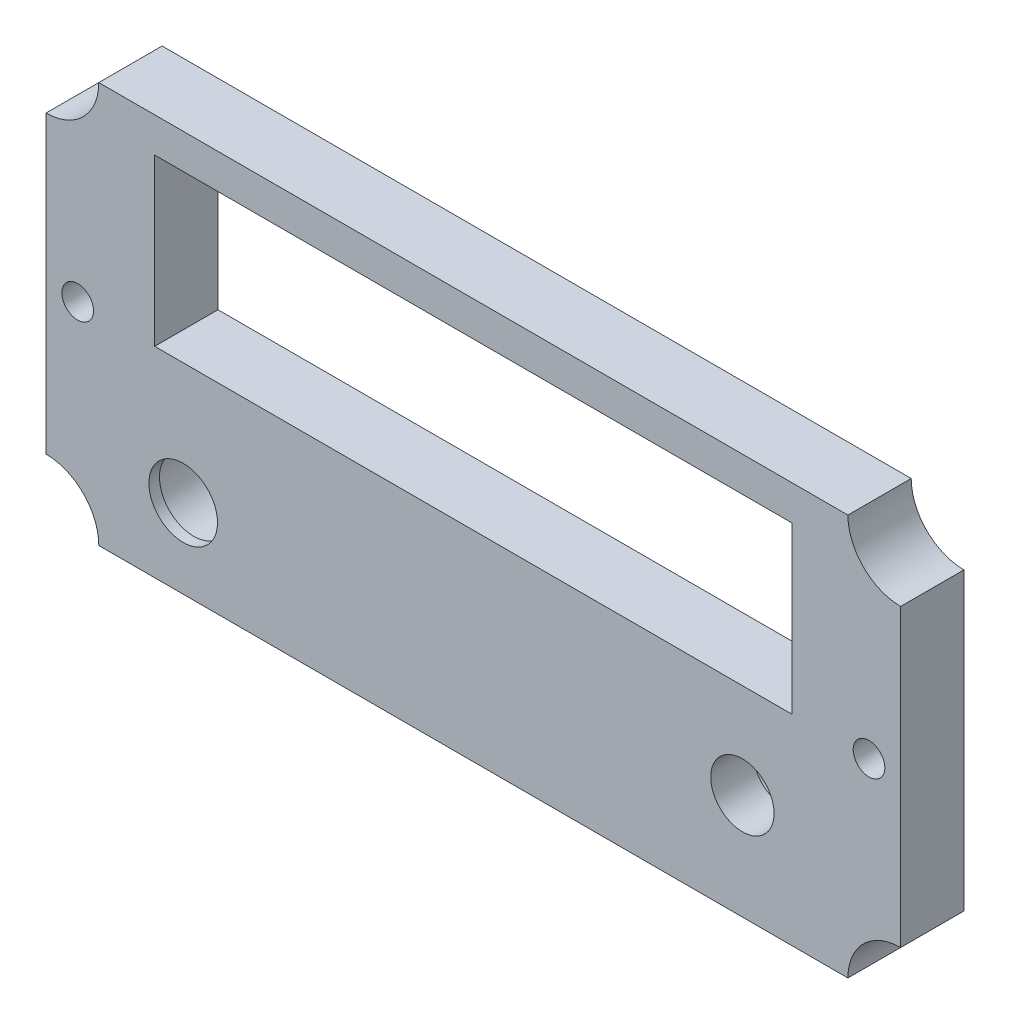
ISO-10303-21;
HEADER;
FILE_DESCRIPTION(('STEP AP214'),'2;1');
FILE_NAME('part.step','',(''),(''),'','','');
FILE_SCHEMA(('AUTOMOTIVE_DESIGN { 1 0 10303 214 1 1 1 1 }'));
ENDSEC;
DATA;
#1=APPLICATION_CONTEXT('core data for automotive mechanical design processes');
#2=APPLICATION_PROTOCOL_DEFINITION('international standard','automotive_design',2000,#1);
#3=PRODUCT_CONTEXT('',#1,'mechanical');
#4=PRODUCT('Part','Part','',(#3));
#5=PRODUCT_RELATED_PRODUCT_CATEGORY('part','',(#4));
#6=PRODUCT_DEFINITION_FORMATION('','',#4);
#7=PRODUCT_DEFINITION_CONTEXT('part definition',#1,'design');
#8=PRODUCT_DEFINITION('design','',#6,#7);
#9=PRODUCT_DEFINITION_SHAPE('','',#8);
#10=(LENGTH_UNIT() NAMED_UNIT(*) SI_UNIT(.MILLI.,.METRE.));
#11=(NAMED_UNIT(*) PLANE_ANGLE_UNIT() SI_UNIT($,.RADIAN.));
#12=(NAMED_UNIT(*) SI_UNIT($,.STERADIAN.) SOLID_ANGLE_UNIT());
#13=UNCERTAINTY_MEASURE_WITH_UNIT(LENGTH_MEASURE(1.E-05),#10,'distance_accuracy_value','');
#14=(GEOMETRIC_REPRESENTATION_CONTEXT(3) GLOBAL_UNCERTAINTY_ASSIGNED_CONTEXT((#13)) GLOBAL_UNIT_ASSIGNED_CONTEXT((#10,
#11,#12)) REPRESENTATION_CONTEXT('',''));
#15=CARTESIAN_POINT('',(0.,0.,0.));
#16=DIRECTION('',(0.,0.,1.));
#17=DIRECTION('',(1.,0.,0.));
#18=AXIS2_PLACEMENT_3D('',#15,#16,#17);
#19=CARTESIAN_POINT('',(25.5,-9.00000000000001,0.));
#20=DIRECTION('',(0.,0.,1.));
#21=DIRECTION('',(1.,0.,0.));
#22=AXIS2_PLACEMENT_3D('',#19,#20,#21);
#23=CYLINDRICAL_SURFACE('',#22,3.425);
#24=CARTESIAN_POINT('',(25.5,-9.00000000000001,0.));
#25=DIRECTION('',(0.,0.,1.));
#26=DIRECTION('',(1.,0.,0.));
#27=AXIS2_PLACEMENT_3D('',#24,#25,#26);
#28=CIRCLE('',#27,3.425);
#29=CARTESIAN_POINT('',(28.925,-9.00000000000001,0.));
#30=VERTEX_POINT('',#29);
#31=EDGE_CURVE('E340',#30,#30,#28,.T.);
#32=ORIENTED_EDGE('',*,*,#31,.F.);
#33=EDGE_LOOP('',(#32));
#34=FACE_BOUND('',#33,.T.);
#35=CARTESIAN_POINT('',(25.5,-9.00000000000001,2.));
#36=DIRECTION('',(0.,0.,1.));
#37=DIRECTION('',(1.,0.,0.));
#38=AXIS2_PLACEMENT_3D('',#35,#36,#37);
#39=CIRCLE('',#38,3.425);
#40=CARTESIAN_POINT('',(28.925,-9.00000000000001,2.));
#41=VERTEX_POINT('',#40);
#42=EDGE_CURVE('E11',#41,#41,#39,.F.);
#43=ORIENTED_EDGE('',*,*,#42,.F.);
#44=EDGE_LOOP('',(#43));
#45=FACE_BOUND('',#44,.T.);
#46=ADVANCED_FACE('F33',(#34,#45),#23,.F.);
#47=CARTESIAN_POINT('',(-27.5,-11.5,0.));
#48=DIRECTION('',(0.,0.,1.));
#49=DIRECTION('',(1.,0.,0.));
#50=AXIS2_PLACEMENT_3D('',#47,#48,#49);
#51=CYLINDRICAL_SURFACE('',#50,3.75);
#52=CARTESIAN_POINT('',(-27.5,-11.5,0.));
#53=DIRECTION('',(0.,0.,1.));
#54=DIRECTION('',(1.,0.,0.));
#55=AXIS2_PLACEMENT_3D('',#52,#53,#54);
#56=CIRCLE('',#55,3.75);
#57=CARTESIAN_POINT('',(-23.75,-11.5,0.));
#58=VERTEX_POINT('',#57);
#59=EDGE_CURVE('E146',#58,#58,#56,.T.);
#60=ORIENTED_EDGE('',*,*,#59,.F.);
#61=EDGE_LOOP('',(#60));
#62=FACE_BOUND('',#61,.T.);
#63=CARTESIAN_POINT('',(-27.5,-11.5,5.));
#64=DIRECTION('',(0.,0.,1.));
#65=DIRECTION('',(1.,0.,0.));
#66=AXIS2_PLACEMENT_3D('',#63,#64,#65);
#67=CIRCLE('',#66,3.75);
#68=CARTESIAN_POINT('',(-23.75,-11.5,5.));
#69=VERTEX_POINT('',#68);
#70=EDGE_CURVE('E41',#69,#69,#67,.F.);
#71=ORIENTED_EDGE('',*,*,#70,.F.);
#72=EDGE_LOOP('',(#71));
#73=FACE_BOUND('',#72,.T.);
#74=ADVANCED_FACE('F235',(#62,#73),#51,.F.);
#75=CARTESIAN_POINT('',(-40.5,19.,6.));
#76=DIRECTION('',(0.,0.,-1.));
#77=DIRECTION('',(-1.,0.,0.));
#78=AXIS2_PLACEMENT_3D('',#75,#76,#77);
#79=CYLINDRICAL_SURFACE('',#78,5.);
#80=CARTESIAN_POINT('',(-40.5,19.,0.));
#81=DIRECTION('',(0.,0.,-1.));
#82=DIRECTION('',(1.,0.,0.));
#83=AXIS2_PLACEMENT_3D('',#80,#81,#82);
#84=CIRCLE('',#83,5.);
#85=CARTESIAN_POINT('',(-35.5,19.,0.));
#86=VERTEX_POINT('',#85);
#87=CARTESIAN_POINT('',(-40.5,14.,0.));
#88=VERTEX_POINT('',#87);
#89=EDGE_CURVE('E173',#86,#88,#84,.T.);
#90=ORIENTED_EDGE('',*,*,#89,.T.);
#91=DIRECTION('',(0.,0.,-1.));
#92=VECTOR('',#91,1.);
#93=CARTESIAN_POINT('',(-40.5,14.,6.));
#94=LINE('',#93,#92);
#95=CARTESIAN_POINT('',(-40.5,14.,6.));
#96=VERTEX_POINT('',#95);
#97=EDGE_CURVE('E228',#96,#88,#94,.T.);
#98=ORIENTED_EDGE('',*,*,#97,.F.);
#99=CARTESIAN_POINT('',(-40.5,19.,6.));
#100=DIRECTION('',(0.,0.,-1.));
#101=DIRECTION('',(1.,0.,0.));
#102=AXIS2_PLACEMENT_3D('',#99,#100,#101);
#103=CIRCLE('',#102,5.);
#104=CARTESIAN_POINT('',(-35.5,19.,6.));
#105=VERTEX_POINT('',#104);
#106=EDGE_CURVE('E174',#105,#96,#103,.T.);
#107=ORIENTED_EDGE('',*,*,#106,.F.);
#108=DIRECTION('',(0.,0.,-1.));
#109=VECTOR('',#108,1.);
#110=CARTESIAN_POINT('',(-35.5,19.,6.));
#111=LINE('',#110,#109);
#112=EDGE_CURVE('E192',#105,#86,#111,.T.);
#113=ORIENTED_EDGE('',*,*,#112,.T.);
#114=EDGE_LOOP('',(#90,#98,#107,#113));
#115=FACE_BOUND('',#114,.T.);
#116=ADVANCED_FACE('F35',(#115),#79,.F.);
#117=CARTESIAN_POINT('',(-40.5,14.,6.));
#118=DIRECTION('',(1.,0.,0.));
#119=DIRECTION('',(0.,0.,-1.));
#120=AXIS2_PLACEMENT_3D('',#117,#118,#119);
#121=PLANE('',#120);
#122=DIRECTION('',(0.,-1.,0.));
#123=VECTOR('',#122,1.);
#124=CARTESIAN_POINT('',(-40.5,14.,0.));
#125=LINE('',#124,#123);
#126=CARTESIAN_POINT('',(-40.5,-14.,0.));
#127=VERTEX_POINT('',#126);
#128=EDGE_CURVE('E195',#88,#127,#125,.T.);
#129=ORIENTED_EDGE('',*,*,#128,.T.);
#130=DIRECTION('',(0.,0.,-1.));
#131=VECTOR('',#130,1.);
#132=CARTESIAN_POINT('',(-40.5,-14.,6.));
#133=LINE('',#132,#131);
#134=CARTESIAN_POINT('',(-40.5,-14.,6.));
#135=VERTEX_POINT('',#134);
#136=EDGE_CURVE('E225',#135,#127,#133,.T.);
#137=ORIENTED_EDGE('',*,*,#136,.F.);
#138=DIRECTION('',(0.,-1.,0.));
#139=VECTOR('',#138,1.);
#140=CARTESIAN_POINT('',(-40.5,14.,6.));
#141=LINE('',#140,#139);
#142=EDGE_CURVE('E177',#96,#135,#141,.T.);
#143=ORIENTED_EDGE('',*,*,#142,.F.);
#144=ORIENTED_EDGE('',*,*,#97,.T.);
#145=EDGE_LOOP('',(#129,#137,#143,#144));
#146=FACE_BOUND('',#145,.T.);
#147=ADVANCED_FACE('F243',(#146),#121,.F.);
#148=CARTESIAN_POINT('',(-40.5,-19.,6.));
#149=DIRECTION('',(0.,0.,-1.));
#150=DIRECTION('',(-1.,0.,0.));
#151=AXIS2_PLACEMENT_3D('',#148,#149,#150);
#152=CYLINDRICAL_SURFACE('',#151,5.);
#153=CARTESIAN_POINT('',(-40.5,-19.,0.));
#154=DIRECTION('',(0.,0.,-1.));
#155=DIRECTION('',(-1.,0.,0.));
#156=AXIS2_PLACEMENT_3D('',#153,#154,#155);
#157=CIRCLE('',#156,5.);
#158=CARTESIAN_POINT('',(-35.5,-19.,0.));
#159=VERTEX_POINT('',#158);
#160=EDGE_CURVE('E197',#127,#159,#157,.T.);
#161=ORIENTED_EDGE('',*,*,#160,.T.);
#162=DIRECTION('',(0.,0.,-1.));
#163=VECTOR('',#162,1.);
#164=CARTESIAN_POINT('',(-35.5,-19.,6.));
#165=LINE('',#164,#163);
#166=CARTESIAN_POINT('',(-35.5,-19.,6.));
#167=VERTEX_POINT('',#166);
#168=EDGE_CURVE('E222',#167,#159,#165,.T.);
#169=ORIENTED_EDGE('',*,*,#168,.F.);
#170=CARTESIAN_POINT('',(-40.5,-19.,6.));
#171=DIRECTION('',(0.,0.,-1.));
#172=DIRECTION('',(-1.,0.,0.));
#173=AXIS2_PLACEMENT_3D('',#170,#171,#172);
#174=CIRCLE('',#173,5.);
#175=EDGE_CURVE('E180',#135,#167,#174,.T.);
#176=ORIENTED_EDGE('',*,*,#175,.F.);
#177=ORIENTED_EDGE('',*,*,#136,.T.);
#178=EDGE_LOOP('',(#161,#169,#176,#177));
#179=FACE_BOUND('',#178,.T.);
#180=ADVANCED_FACE('F296',(#179),#152,.F.);
#181=CARTESIAN_POINT('',(-35.5,-19.,6.));
#182=DIRECTION('',(0.,1.,0.));
#183=DIRECTION('',(-1.,0.,0.));
#184=AXIS2_PLACEMENT_3D('',#181,#182,#183);
#185=PLANE('',#184);
#186=DIRECTION('',(1.,0.,0.));
#187=VECTOR('',#186,1.);
#188=CARTESIAN_POINT('',(-35.5,-19.,0.));
#189=LINE('',#188,#187);
#190=CARTESIAN_POINT('',(35.5,-19.,0.));
#191=VERTEX_POINT('',#190);
#192=EDGE_CURVE('E199',#159,#191,#189,.T.);
#193=ORIENTED_EDGE('',*,*,#192,.T.);
#194=DIRECTION('',(0.,0.,-1.));
#195=VECTOR('',#194,1.);
#196=CARTESIAN_POINT('',(35.5,-19.,6.));
#197=LINE('',#196,#195);
#198=CARTESIAN_POINT('',(35.5,-19.,6.));
#199=VERTEX_POINT('',#198);
#200=EDGE_CURVE('E219',#199,#191,#197,.T.);
#201=ORIENTED_EDGE('',*,*,#200,.F.);
#202=DIRECTION('',(1.,0.,0.));
#203=VECTOR('',#202,1.);
#204=CARTESIAN_POINT('',(-35.5,-19.,6.));
#205=LINE('',#204,#203);
#206=EDGE_CURVE('E182',#167,#199,#205,.T.);
#207=ORIENTED_EDGE('',*,*,#206,.F.);
#208=ORIENTED_EDGE('',*,*,#168,.T.);
#209=EDGE_LOOP('',(#193,#201,#207,#208));
#210=FACE_BOUND('',#209,.T.);
#211=ADVANCED_FACE('F292',(#210),#185,.F.);
#212=CARTESIAN_POINT('',(40.5,-19.,6.));
#213=DIRECTION('',(0.,0.,-1.));
#214=DIRECTION('',(-1.,0.,0.));
#215=AXIS2_PLACEMENT_3D('',#212,#213,#214);
#216=CYLINDRICAL_SURFACE('',#215,5.);
#217=CARTESIAN_POINT('',(40.5,-19.,0.));
#218=DIRECTION('',(0.,0.,-1.));
#219=DIRECTION('',(1.,0.,0.));
#220=AXIS2_PLACEMENT_3D('',#217,#218,#219);
#221=CIRCLE('',#220,5.);
#222=CARTESIAN_POINT('',(40.5,-14.,0.));
#223=VERTEX_POINT('',#222);
#224=EDGE_CURVE('E201',#191,#223,#221,.T.);
#225=ORIENTED_EDGE('',*,*,#224,.T.);
#226=DIRECTION('',(0.,0.,-1.));
#227=VECTOR('',#226,1.);
#228=CARTESIAN_POINT('',(40.5,-14.,6.));
#229=LINE('',#228,#227);
#230=CARTESIAN_POINT('',(40.5,-14.,6.));
#231=VERTEX_POINT('',#230);
#232=EDGE_CURVE('E216',#231,#223,#229,.T.);
#233=ORIENTED_EDGE('',*,*,#232,.F.);
#234=CARTESIAN_POINT('',(40.5,-19.,6.));
#235=DIRECTION('',(0.,0.,-1.));
#236=DIRECTION('',(1.,0.,0.));
#237=AXIS2_PLACEMENT_3D('',#234,#235,#236);
#238=CIRCLE('',#237,5.);
#239=EDGE_CURVE('E184',#199,#231,#238,.T.);
#240=ORIENTED_EDGE('',*,*,#239,.F.);
#241=ORIENTED_EDGE('',*,*,#200,.T.);
#242=EDGE_LOOP('',(#225,#233,#240,#241));
#243=FACE_BOUND('',#242,.T.);
#244=ADVANCED_FACE('F288',(#243),#216,.F.);
#245=CARTESIAN_POINT('',(40.5,14.,6.));
#246=DIRECTION('',(-1.,0.,0.));
#247=DIRECTION('',(0.,0.,1.));
#248=AXIS2_PLACEMENT_3D('',#245,#246,#247);
#249=PLANE('',#248);
#250=DIRECTION('',(0.,1.,0.));
#251=VECTOR('',#250,1.);
#252=CARTESIAN_POINT('',(40.5,14.,0.));
#253=LINE('',#252,#251);
#254=CARTESIAN_POINT('',(40.5,14.,0.));
#255=VERTEX_POINT('',#254);
#256=EDGE_CURVE('E203',#223,#255,#253,.T.);
#257=ORIENTED_EDGE('',*,*,#256,.T.);
#258=DIRECTION('',(0.,0.,-1.));
#259=VECTOR('',#258,1.);
#260=CARTESIAN_POINT('',(40.5,14.,6.));
#261=LINE('',#260,#259);
#262=CARTESIAN_POINT('',(40.5,14.,6.));
#263=VERTEX_POINT('',#262);
#264=EDGE_CURVE('E213',#263,#255,#261,.T.);
#265=ORIENTED_EDGE('',*,*,#264,.F.);
#266=DIRECTION('',(0.,1.,0.));
#267=VECTOR('',#266,1.);
#268=CARTESIAN_POINT('',(40.5,14.,6.));
#269=LINE('',#268,#267);
#270=EDGE_CURVE('E186',#231,#263,#269,.T.);
#271=ORIENTED_EDGE('',*,*,#270,.F.);
#272=ORIENTED_EDGE('',*,*,#232,.T.);
#273=EDGE_LOOP('',(#257,#265,#271,#272));
#274=FACE_BOUND('',#273,.T.);
#275=ADVANCED_FACE('F284',(#274),#249,.F.);
#276=CARTESIAN_POINT('',(40.5,19.,6.));
#277=DIRECTION('',(0.,0.,-1.));
#278=DIRECTION('',(-1.,0.,0.));
#279=AXIS2_PLACEMENT_3D('',#276,#277,#278);
#280=CYLINDRICAL_SURFACE('',#279,5.00000000000001);
#281=CARTESIAN_POINT('',(40.5,19.,0.));
#282=DIRECTION('',(0.,0.,-1.));
#283=DIRECTION('',(-1.,0.,0.));
#284=AXIS2_PLACEMENT_3D('',#281,#282,#283);
#285=CIRCLE('',#284,5.00000000000001);
#286=CARTESIAN_POINT('',(35.5,19.,0.));
#287=VERTEX_POINT('',#286);
#288=EDGE_CURVE('E205',#255,#287,#285,.T.);
#289=ORIENTED_EDGE('',*,*,#288,.T.);
#290=DIRECTION('',(0.,0.,-1.));
#291=VECTOR('',#290,1.);
#292=CARTESIAN_POINT('',(35.5,19.,6.));
#293=LINE('',#292,#291);
#294=CARTESIAN_POINT('',(35.5,19.,6.));
#295=VERTEX_POINT('',#294);
#296=EDGE_CURVE('E210',#295,#287,#293,.T.);
#297=ORIENTED_EDGE('',*,*,#296,.F.);
#298=CARTESIAN_POINT('',(40.5,19.,6.));
#299=DIRECTION('',(0.,0.,-1.));
#300=DIRECTION('',(-1.,0.,0.));
#301=AXIS2_PLACEMENT_3D('',#298,#299,#300);
#302=CIRCLE('',#301,5.00000000000001);
#303=EDGE_CURVE('E188',#263,#295,#302,.T.);
#304=ORIENTED_EDGE('',*,*,#303,.F.);
#305=ORIENTED_EDGE('',*,*,#264,.T.);
#306=EDGE_LOOP('',(#289,#297,#304,#305));
#307=FACE_BOUND('',#306,.T.);
#308=ADVANCED_FACE('F280',(#307),#280,.F.);
#309=CARTESIAN_POINT('',(-35.5,19.,6.));
#310=DIRECTION('',(0.,-1.,0.));
#311=DIRECTION('',(1.,0.,0.));
#312=AXIS2_PLACEMENT_3D('',#309,#310,#311);
#313=PLANE('',#312);
#314=DIRECTION('',(-1.,0.,0.));
#315=VECTOR('',#314,1.);
#316=CARTESIAN_POINT('',(-35.5,19.,0.));
#317=LINE('',#316,#315);
#318=EDGE_CURVE('E178',#287,#86,#317,.T.);
#319=ORIENTED_EDGE('',*,*,#318,.T.);
#320=ORIENTED_EDGE('',*,*,#112,.F.);
#321=DIRECTION('',(-1.,0.,0.));
#322=VECTOR('',#321,1.);
#323=CARTESIAN_POINT('',(-35.5,19.,6.));
#324=LINE('',#323,#322);
#325=EDGE_CURVE('E190',#295,#105,#324,.T.);
#326=ORIENTED_EDGE('',*,*,#325,.F.);
#327=ORIENTED_EDGE('',*,*,#296,.T.);
#328=EDGE_LOOP('',(#319,#320,#326,#327));
#329=FACE_BOUND('',#328,.T.);
#330=ADVANCED_FACE('F273',(#329),#313,.F.);
#331=CARTESIAN_POINT('',(-40.5,19.,6.));
#332=DIRECTION('',(0.,0.,1.));
#333=DIRECTION('',(1.,0.,0.));
#334=AXIS2_PLACEMENT_3D('',#331,#332,#333);
#335=PLANE('',#334);
#336=DIRECTION('',(0.,-1.,0.));
#337=VECTOR('',#336,1.);
#338=CARTESIAN_POINT('',(-30.2,15.7,6.));
#339=LINE('',#338,#337);
#340=CARTESIAN_POINT('',(-30.2,15.7,6.));
#341=VERTEX_POINT('',#340);
#342=CARTESIAN_POINT('',(-30.2,0.,6.));
#343=VERTEX_POINT('',#342);
#344=EDGE_CURVE('E48',#341,#343,#339,.T.);
#345=ORIENTED_EDGE('',*,*,#344,.F.);
#346=DIRECTION('',(-1.,0.,0.));
#347=VECTOR('',#346,1.);
#348=CARTESIAN_POINT('',(-30.2,15.7,6.));
#349=LINE('',#348,#347);
#350=CARTESIAN_POINT('',(30.2,15.7,6.));
#351=VERTEX_POINT('',#350);
#352=EDGE_CURVE('E140',#351,#341,#349,.T.);
#353=ORIENTED_EDGE('',*,*,#352,.F.);
#354=DIRECTION('',(0.,1.,0.));
#355=VECTOR('',#354,1.);
#356=CARTESIAN_POINT('',(30.2,15.7,6.));
#357=LINE('',#356,#355);
#358=CARTESIAN_POINT('',(30.2,0.,6.));
#359=VERTEX_POINT('',#358);
#360=EDGE_CURVE('E143',#359,#351,#357,.T.);
#361=ORIENTED_EDGE('',*,*,#360,.F.);
#362=DIRECTION('',(1.,0.,0.));
#363=VECTOR('',#362,1.);
#364=CARTESIAN_POINT('',(-30.2,0.,6.));
#365=LINE('',#364,#363);
#366=EDGE_CURVE('E152',#343,#359,#365,.T.);
#367=ORIENTED_EDGE('',*,*,#366,.F.);
#368=EDGE_LOOP('',(#345,#353,#361,#367));
#369=FACE_BOUND('',#368,.T.);
#370=CARTESIAN_POINT('',(-37.5,0.,6.));
#371=DIRECTION('',(0.,0.,1.));
#372=DIRECTION('',(1.,0.,0.));
#373=AXIS2_PLACEMENT_3D('',#370,#371,#372);
#374=CIRCLE('',#373,1.5);
#375=CARTESIAN_POINT('',(-36.,0.,6.));
#376=VERTEX_POINT('',#375);
#377=EDGE_CURVE('E170',#376,#376,#374,.T.);
#378=ORIENTED_EDGE('',*,*,#377,.F.);
#379=EDGE_LOOP('',(#378));
#380=FACE_BOUND('',#379,.T.);
#381=CARTESIAN_POINT('',(37.5,0.,6.));
#382=DIRECTION('',(0.,0.,1.));
#383=DIRECTION('',(1.,0.,0.));
#384=AXIS2_PLACEMENT_3D('',#381,#382,#383);
#385=CIRCLE('',#384,1.5);
#386=CARTESIAN_POINT('',(39.,0.,6.));
#387=VERTEX_POINT('',#386);
#388=EDGE_CURVE('E165',#387,#387,#385,.T.);
#389=ORIENTED_EDGE('',*,*,#388,.F.);
#390=EDGE_LOOP('',(#389));
#391=FACE_BOUND('',#390,.T.);
#392=ORIENTED_EDGE('',*,*,#106,.T.);
#393=ORIENTED_EDGE('',*,*,#142,.T.);
#394=ORIENTED_EDGE('',*,*,#175,.T.);
#395=ORIENTED_EDGE('',*,*,#206,.T.);
#396=ORIENTED_EDGE('',*,*,#239,.T.);
#397=ORIENTED_EDGE('',*,*,#270,.T.);
#398=ORIENTED_EDGE('',*,*,#303,.T.);
#399=ORIENTED_EDGE('',*,*,#325,.T.);
#400=EDGE_LOOP('',(#392,#393,#394,#395,#396,#397,#398,#399));
#401=FACE_BOUND('',#400,.T.);
#402=CARTESIAN_POINT('',(-27.5,-11.5,6.));
#403=DIRECTION('',(0.,0.,1.));
#404=DIRECTION('',(1.,0.,0.));
#405=AXIS2_PLACEMENT_3D('',#402,#403,#404);
#406=CIRCLE('',#405,3.25);
#407=CARTESIAN_POINT('',(-24.25,-11.5,6.));
#408=VERTEX_POINT('',#407);
#409=EDGE_CURVE('E332',#408,#408,#406,.T.);
#410=ORIENTED_EDGE('',*,*,#409,.F.);
#411=EDGE_LOOP('',(#410));
#412=FACE_BOUND('',#411,.T.);
#413=CARTESIAN_POINT('',(25.5,-9.00000000000001,6.));
#414=DIRECTION('',(0.,0.,1.));
#415=DIRECTION('',(1.,0.,0.));
#416=AXIS2_PLACEMENT_3D('',#413,#414,#415);
#417=CIRCLE('',#416,3.);
#418=CARTESIAN_POINT('',(28.5,-9.00000000000001,6.));
#419=VERTEX_POINT('',#418);
#420=EDGE_CURVE('E335',#419,#419,#417,.T.);
#421=ORIENTED_EDGE('',*,*,#420,.F.);
#422=EDGE_LOOP('',(#421));
#423=FACE_BOUND('',#422,.T.);
#424=ADVANCED_FACE('F270',(#369,#380,#391,#401,#412,#423),#335,.T.);
#425=CARTESIAN_POINT('',(-40.5,19.,0.));
#426=DIRECTION('',(0.,0.,1.));
#427=DIRECTION('',(1.,0.,0.));
#428=AXIS2_PLACEMENT_3D('',#425,#426,#427);
#429=PLANE('',#428);
#430=ORIENTED_EDGE('',*,*,#31,.T.);
#431=EDGE_LOOP('',(#430));
#432=FACE_BOUND('',#431,.T.);
#433=ORIENTED_EDGE('',*,*,#59,.T.);
#434=EDGE_LOOP('',(#433));
#435=FACE_BOUND('',#434,.T.);
#436=DIRECTION('',(-1.,0.,0.));
#437=VECTOR('',#436,1.);
#438=CARTESIAN_POINT('',(-30.2,15.7,0.));
#439=LINE('',#438,#437);
#440=CARTESIAN_POINT('',(30.2,15.7,0.));
#441=VERTEX_POINT('',#440);
#442=CARTESIAN_POINT('',(-30.2,15.7,0.));
#443=VERTEX_POINT('',#442);
#444=EDGE_CURVE('E130',#441,#443,#439,.T.);
#445=ORIENTED_EDGE('',*,*,#444,.T.);
#446=DIRECTION('',(0.,-1.,0.));
#447=VECTOR('',#446,1.);
#448=CARTESIAN_POINT('',(-30.2,15.7,0.));
#449=LINE('',#448,#447);
#450=CARTESIAN_POINT('',(-30.2,0.,0.));
#451=VERTEX_POINT('',#450);
#452=EDGE_CURVE('E124',#443,#451,#449,.T.);
#453=ORIENTED_EDGE('',*,*,#452,.T.);
#454=DIRECTION('',(1.,0.,0.));
#455=VECTOR('',#454,1.);
#456=CARTESIAN_POINT('',(-30.2,0.,0.));
#457=LINE('',#456,#455);
#458=CARTESIAN_POINT('',(30.2,0.,0.));
#459=VERTEX_POINT('',#458);
#460=EDGE_CURVE('E133',#451,#459,#457,.T.);
#461=ORIENTED_EDGE('',*,*,#460,.T.);
#462=DIRECTION('',(0.,1.,0.));
#463=VECTOR('',#462,1.);
#464=CARTESIAN_POINT('',(30.2,15.7,0.));
#465=LINE('',#464,#463);
#466=EDGE_CURVE('E56',#459,#441,#465,.T.);
#467=ORIENTED_EDGE('',*,*,#466,.T.);
#468=EDGE_LOOP('',(#445,#453,#461,#467));
#469=FACE_BOUND('',#468,.T.);
#470=CARTESIAN_POINT('',(-37.5,0.,0.));
#471=DIRECTION('',(0.,0.,1.));
#472=DIRECTION('',(1.,0.,0.));
#473=AXIS2_PLACEMENT_3D('',#470,#471,#472);
#474=CIRCLE('',#473,1.5);
#475=CARTESIAN_POINT('',(-36.,0.,0.));
#476=VERTEX_POINT('',#475);
#477=EDGE_CURVE('E162',#476,#476,#474,.T.);
#478=ORIENTED_EDGE('',*,*,#477,.T.);
#479=EDGE_LOOP('',(#478));
#480=FACE_BOUND('',#479,.T.);
#481=CARTESIAN_POINT('',(37.5,0.,0.));
#482=DIRECTION('',(0.,0.,1.));
#483=DIRECTION('',(-1.,0.,0.));
#484=AXIS2_PLACEMENT_3D('',#481,#482,#483);
#485=CIRCLE('',#484,1.5);
#486=CARTESIAN_POINT('',(36.,0.,0.));
#487=VERTEX_POINT('',#486);
#488=EDGE_CURVE('E158',#487,#487,#485,.T.);
#489=ORIENTED_EDGE('',*,*,#488,.T.);
#490=EDGE_LOOP('',(#489));
#491=FACE_BOUND('',#490,.T.);
#492=ORIENTED_EDGE('',*,*,#89,.F.);
#493=ORIENTED_EDGE('',*,*,#318,.F.);
#494=ORIENTED_EDGE('',*,*,#288,.F.);
#495=ORIENTED_EDGE('',*,*,#256,.F.);
#496=ORIENTED_EDGE('',*,*,#224,.F.);
#497=ORIENTED_EDGE('',*,*,#192,.F.);
#498=ORIENTED_EDGE('',*,*,#160,.F.);
#499=ORIENTED_EDGE('',*,*,#128,.F.);
#500=EDGE_LOOP('',(#492,#493,#494,#495,#496,#497,#498,#499));
#501=FACE_BOUND('',#500,.T.);
#502=ADVANCED_FACE('F137',(#432,#435,#469,#480,#491,#501),#429,.F.);
#503=CARTESIAN_POINT('',(37.5,0.,0.));
#504=DIRECTION('',(0.,0.,1.));
#505=DIRECTION('',(1.,0.,0.));
#506=AXIS2_PLACEMENT_3D('',#503,#504,#505);
#507=CYLINDRICAL_SURFACE('',#506,1.5);
#508=ORIENTED_EDGE('',*,*,#388,.T.);
#509=EDGE_LOOP('',(#508));
#510=FACE_BOUND('',#509,.T.);
#511=ORIENTED_EDGE('',*,*,#488,.F.);
#512=EDGE_LOOP('',(#511));
#513=FACE_BOUND('',#512,.T.);
#514=ADVANCED_FACE('F265',(#510,#513),#507,.F.);
#515=CARTESIAN_POINT('',(-37.5,0.,0.));
#516=DIRECTION('',(0.,0.,1.));
#517=DIRECTION('',(1.,0.,0.));
#518=AXIS2_PLACEMENT_3D('',#515,#516,#517);
#519=CYLINDRICAL_SURFACE('',#518,1.5);
#520=ORIENTED_EDGE('',*,*,#377,.T.);
#521=EDGE_LOOP('',(#520));
#522=FACE_BOUND('',#521,.T.);
#523=ORIENTED_EDGE('',*,*,#477,.F.);
#524=EDGE_LOOP('',(#523));
#525=FACE_BOUND('',#524,.T.);
#526=ADVANCED_FACE('F262',(#522,#525),#519,.F.);
#527=CARTESIAN_POINT('',(-30.2,15.7,0.));
#528=DIRECTION('',(-1.,0.,0.));
#529=DIRECTION('',(0.,0.,1.));
#530=AXIS2_PLACEMENT_3D('',#527,#528,#529);
#531=PLANE('',#530);
#532=ORIENTED_EDGE('',*,*,#344,.T.);
#533=DIRECTION('',(0.,0.,1.));
#534=VECTOR('',#533,1.);
#535=CARTESIAN_POINT('',(-30.2,0.,0.));
#536=LINE('',#535,#534);
#537=EDGE_CURVE('E120',#451,#343,#536,.T.);
#538=ORIENTED_EDGE('',*,*,#537,.F.);
#539=ORIENTED_EDGE('',*,*,#452,.F.);
#540=DIRECTION('',(0.,0.,1.));
#541=VECTOR('',#540,1.);
#542=CARTESIAN_POINT('',(-30.2,15.7,0.));
#543=LINE('',#542,#541);
#544=EDGE_CURVE('E156',#443,#341,#543,.T.);
#545=ORIENTED_EDGE('',*,*,#544,.T.);
#546=EDGE_LOOP('',(#532,#538,#539,#545));
#547=FACE_BOUND('',#546,.T.);
#548=ADVANCED_FACE('F122',(#547),#531,.F.);
#549=CARTESIAN_POINT('',(-30.2,15.7,0.));
#550=DIRECTION('',(0.,1.,0.));
#551=DIRECTION('',(-1.,0.,0.));
#552=AXIS2_PLACEMENT_3D('',#549,#550,#551);
#553=PLANE('',#552);
#554=ORIENTED_EDGE('',*,*,#352,.T.);
#555=ORIENTED_EDGE('',*,*,#544,.F.);
#556=ORIENTED_EDGE('',*,*,#444,.F.);
#557=DIRECTION('',(0.,0.,1.));
#558=VECTOR('',#557,1.);
#559=CARTESIAN_POINT('',(30.2,15.7,0.));
#560=LINE('',#559,#558);
#561=EDGE_CURVE('E159',#441,#351,#560,.T.);
#562=ORIENTED_EDGE('',*,*,#561,.T.);
#563=EDGE_LOOP('',(#554,#555,#556,#562));
#564=FACE_BOUND('',#563,.T.);
#565=ADVANCED_FACE('F251',(#564),#553,.F.);
#566=CARTESIAN_POINT('',(30.2,15.7,0.));
#567=DIRECTION('',(1.,0.,0.));
#568=DIRECTION('',(0.,1.,0.));
#569=AXIS2_PLACEMENT_3D('',#566,#567,#568);
#570=PLANE('',#569);
#571=ORIENTED_EDGE('',*,*,#360,.T.);
#572=ORIENTED_EDGE('',*,*,#561,.F.);
#573=ORIENTED_EDGE('',*,*,#466,.F.);
#574=DIRECTION('',(0.,0.,1.));
#575=VECTOR('',#574,1.);
#576=CARTESIAN_POINT('',(30.2,0.,0.));
#577=LINE('',#576,#575);
#578=EDGE_CURVE('E129',#459,#359,#577,.T.);
#579=ORIENTED_EDGE('',*,*,#578,.T.);
#580=EDGE_LOOP('',(#571,#572,#573,#579));
#581=FACE_BOUND('',#580,.T.);
#582=ADVANCED_FACE('F254',(#581),#570,.F.);
#583=CARTESIAN_POINT('',(-30.2,0.,0.));
#584=DIRECTION('',(0.,-1.,0.));
#585=DIRECTION('',(0.,0.,-1.));
#586=AXIS2_PLACEMENT_3D('',#583,#584,#585);
#587=PLANE('',#586);
#588=ORIENTED_EDGE('',*,*,#366,.T.);
#589=ORIENTED_EDGE('',*,*,#578,.F.);
#590=ORIENTED_EDGE('',*,*,#460,.F.);
#591=ORIENTED_EDGE('',*,*,#537,.T.);
#592=EDGE_LOOP('',(#588,#589,#590,#591));
#593=FACE_BOUND('',#592,.T.);
#594=ADVANCED_FACE('F134',(#593),#587,.F.);
#595=CARTESIAN_POINT('',(-27.5,-11.5,5.));
#596=DIRECTION('',(0.,0.,1.));
#597=DIRECTION('',(1.,0.,0.));
#598=AXIS2_PLACEMENT_3D('',#595,#596,#597);
#599=PLANE('',#598);
#600=CARTESIAN_POINT('',(-27.5,-11.5,5.));
#601=DIRECTION('',(0.,0.,1.));
#602=DIRECTION('',(1.,0.,0.));
#603=AXIS2_PLACEMENT_3D('',#600,#601,#602);
#604=CIRCLE('',#603,3.25);
#605=CARTESIAN_POINT('',(-24.25,-11.5,5.));
#606=VERTEX_POINT('',#605);
#607=EDGE_CURVE('E345',#606,#606,#604,.T.);
#608=ORIENTED_EDGE('',*,*,#607,.T.);
#609=EDGE_LOOP('',(#608));
#610=FACE_BOUND('',#609,.T.);
#611=ORIENTED_EDGE('',*,*,#70,.T.);
#612=EDGE_LOOP('',(#611));
#613=FACE_BOUND('',#612,.T.);
#614=ADVANCED_FACE('F233',(#610,#613),#599,.F.);
#615=CARTESIAN_POINT('',(-27.5,-11.5,5.));
#616=DIRECTION('',(0.,0.,1.));
#617=DIRECTION('',(1.,0.,0.));
#618=AXIS2_PLACEMENT_3D('',#615,#616,#617);
#619=CYLINDRICAL_SURFACE('',#618,3.25);
#620=ORIENTED_EDGE('',*,*,#607,.F.);
#621=EDGE_LOOP('',(#620));
#622=FACE_BOUND('',#621,.T.);
#623=ORIENTED_EDGE('',*,*,#409,.T.);
#624=EDGE_LOOP('',(#623));
#625=FACE_BOUND('',#624,.T.);
#626=ADVANCED_FACE('F348',(#622,#625),#619,.F.);
#627=CARTESIAN_POINT('',(25.5,-9.00000000000001,2.));
#628=DIRECTION('',(0.,0.,1.));
#629=DIRECTION('',(1.,0.,0.));
#630=AXIS2_PLACEMENT_3D('',#627,#628,#629);
#631=PLANE('',#630);
#632=CARTESIAN_POINT('',(25.5,-9.00000000000001,2.));
#633=DIRECTION('',(0.,0.,1.));
#634=DIRECTION('',(1.,0.,0.));
#635=AXIS2_PLACEMENT_3D('',#632,#633,#634);
#636=CIRCLE('',#635,3.);
#637=CARTESIAN_POINT('',(28.5,-9.00000000000001,2.));
#638=VERTEX_POINT('',#637);
#639=EDGE_CURVE('E337',#638,#638,#636,.T.);
#640=ORIENTED_EDGE('',*,*,#639,.T.);
#641=EDGE_LOOP('',(#640));
#642=FACE_BOUND('',#641,.T.);
#643=ORIENTED_EDGE('',*,*,#42,.T.);
#644=EDGE_LOOP('',(#643));
#645=FACE_BOUND('',#644,.T.);
#646=ADVANCED_FACE('F350',(#642,#645),#631,.F.);
#647=CARTESIAN_POINT('',(25.5,-9.00000000000001,2.));
#648=DIRECTION('',(0.,0.,1.));
#649=DIRECTION('',(1.,0.,0.));
#650=AXIS2_PLACEMENT_3D('',#647,#648,#649);
#651=CYLINDRICAL_SURFACE('',#650,3.);
#652=ORIENTED_EDGE('',*,*,#639,.F.);
#653=EDGE_LOOP('',(#652));
#654=FACE_BOUND('',#653,.T.);
#655=ORIENTED_EDGE('',*,*,#420,.T.);
#656=EDGE_LOOP('',(#655));
#657=FACE_BOUND('',#656,.T.);
#658=ADVANCED_FACE('F356',(#654,#657),#651,.F.);
#659=CLOSED_SHELL('',(#46,#74,#116,#147,#180,#211,#244,#275,#308,#330,#424,#502,#514,#526,#548,
#565,#582,#594,#614,#626,#646,#658));
#660=MANIFOLD_SOLID_BREP('B2',#659);
#661=ADVANCED_BREP_SHAPE_REPRESENTATION('',(#18,#660),#14);
#662=SHAPE_DEFINITION_REPRESENTATION(#9,#661);
ENDSEC;
END-ISO-10303-21;
